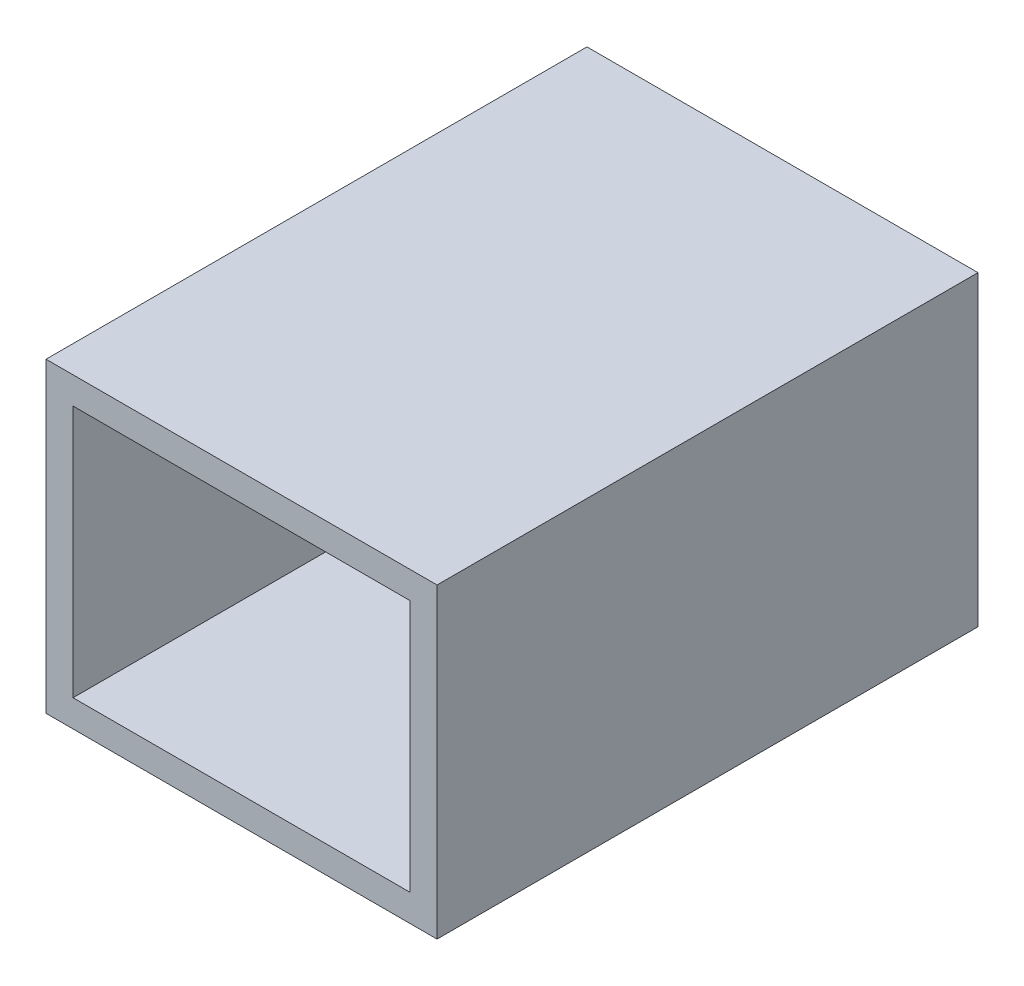
ISO-10303-21;
HEADER;
FILE_DESCRIPTION(('STEP AP214'),'2;1');
FILE_NAME('part.step','',(''),(''),'','','');
FILE_SCHEMA(('AUTOMOTIVE_DESIGN { 1 0 10303 214 1 1 1 1 }'));
ENDSEC;
DATA;
#1=APPLICATION_CONTEXT('core data for automotive mechanical design processes');
#2=APPLICATION_PROTOCOL_DEFINITION('international standard','automotive_design',2000,#1);
#3=PRODUCT_CONTEXT('',#1,'mechanical');
#4=PRODUCT('Part','Part','',(#3));
#5=PRODUCT_RELATED_PRODUCT_CATEGORY('part','',(#4));
#6=PRODUCT_DEFINITION_FORMATION('','',#4);
#7=PRODUCT_DEFINITION_CONTEXT('part definition',#1,'design');
#8=PRODUCT_DEFINITION('design','',#6,#7);
#9=PRODUCT_DEFINITION_SHAPE('','',#8);
#10=(LENGTH_UNIT() NAMED_UNIT(*) SI_UNIT(.MILLI.,.METRE.));
#11=(NAMED_UNIT(*) PLANE_ANGLE_UNIT() SI_UNIT($,.RADIAN.));
#12=(NAMED_UNIT(*) SI_UNIT($,.STERADIAN.) SOLID_ANGLE_UNIT());
#13=UNCERTAINTY_MEASURE_WITH_UNIT(LENGTH_MEASURE(1.E-05),#10,'distance_accuracy_value','');
#14=(GEOMETRIC_REPRESENTATION_CONTEXT(3) GLOBAL_UNCERTAINTY_ASSIGNED_CONTEXT((#13)) GLOBAL_UNIT_ASSIGNED_CONTEXT((#10,
#11,#12)) REPRESENTATION_CONTEXT('',''));
#15=CARTESIAN_POINT('',(0.,0.,0.));
#16=DIRECTION('',(0.,0.,1.));
#17=DIRECTION('',(1.,0.,0.));
#18=AXIS2_PLACEMENT_3D('',#15,#16,#17);
#19=CARTESIAN_POINT('',(0.,0.,200.));
#20=DIRECTION('',(0.,0.,-1.));
#21=DIRECTION('',(-1.,0.,0.));
#22=AXIS2_PLACEMENT_3D('',#19,#20,#21);
#23=PLANE('',#22);
#24=DIRECTION('',(0.,1.,0.));
#25=VECTOR('',#24,1.);
#26=CARTESIAN_POINT('',(72.2835547727534,-56.6956910569106,200.));
#27=LINE('',#26,#25);
#28=CARTESIAN_POINT('',(72.2835547727534,-56.6956910569106,200.));
#29=VERTEX_POINT('',#28);
#30=CARTESIAN_POINT('',(72.2835547727534,56.6956910569106,200.));
#31=VERTEX_POINT('',#30);
#32=EDGE_CURVE('E141',#29,#31,#27,.T.);
#33=ORIENTED_EDGE('',*,*,#32,.T.);
#34=DIRECTION('',(-1.,0.,0.));
#35=VECTOR('',#34,1.);
#36=CARTESIAN_POINT('',(-72.2835547727534,56.6956910569106,200.));
#37=LINE('',#36,#35);
#38=CARTESIAN_POINT('',(-72.2835547727534,56.6956910569106,200.));
#39=VERTEX_POINT('',#38);
#40=EDGE_CURVE('E85',#31,#39,#37,.T.);
#41=ORIENTED_EDGE('',*,*,#40,.T.);
#42=DIRECTION('',(0.,-1.,0.));
#43=VECTOR('',#42,1.);
#44=CARTESIAN_POINT('',(-72.2835547727534,-56.6956910569106,200.));
#45=LINE('',#44,#43);
#46=CARTESIAN_POINT('',(-72.2835547727534,-56.6956910569106,200.));
#47=VERTEX_POINT('',#46);
#48=EDGE_CURVE('E144',#39,#47,#45,.T.);
#49=ORIENTED_EDGE('',*,*,#48,.T.);
#50=DIRECTION('',(1.,0.,0.));
#51=VECTOR('',#50,1.);
#52=CARTESIAN_POINT('',(-72.2835547727534,-56.6956910569106,200.));
#53=LINE('',#52,#51);
#54=EDGE_CURVE('E57',#47,#29,#53,.T.);
#55=ORIENTED_EDGE('',*,*,#54,.T.);
#56=EDGE_LOOP('',(#33,#41,#49,#55));
#57=FACE_BOUND('',#56,.T.);
#58=DIRECTION('',(0.,1.,0.));
#59=VECTOR('',#58,1.);
#60=CARTESIAN_POINT('',(62.2835547727534,0.,200.));
#61=LINE('',#60,#59);
#62=CARTESIAN_POINT('',(62.2835547727534,-46.6956910569106,200.));
#63=VERTEX_POINT('',#62);
#64=CARTESIAN_POINT('',(62.2835547727534,46.6956910569106,200.));
#65=VERTEX_POINT('',#64);
#66=EDGE_CURVE('E130',#63,#65,#61,.T.);
#67=ORIENTED_EDGE('',*,*,#66,.F.);
#68=DIRECTION('',(1.,0.,0.));
#69=VECTOR('',#68,1.);
#70=CARTESIAN_POINT('',(0.,-46.6956910569106,200.));
#71=LINE('',#70,#69);
#72=CARTESIAN_POINT('',(-62.2835547727534,-46.6956910569106,200.));
#73=VERTEX_POINT('',#72);
#74=EDGE_CURVE('E139',#73,#63,#71,.T.);
#75=ORIENTED_EDGE('',*,*,#74,.F.);
#76=DIRECTION('',(0.,-1.,0.));
#77=VECTOR('',#76,1.);
#78=CARTESIAN_POINT('',(-62.2835547727534,0.,200.));
#79=LINE('',#78,#77);
#80=CARTESIAN_POINT('',(-62.2835547727534,46.6956910569106,200.));
#81=VERTEX_POINT('',#80);
#82=EDGE_CURVE('E137',#81,#73,#79,.T.);
#83=ORIENTED_EDGE('',*,*,#82,.F.);
#84=DIRECTION('',(-1.,0.,0.));
#85=VECTOR('',#84,1.);
#86=CARTESIAN_POINT('',(0.,46.6956910569106,200.));
#87=LINE('',#86,#85);
#88=EDGE_CURVE('E122',#65,#81,#87,.T.);
#89=ORIENTED_EDGE('',*,*,#88,.F.);
#90=EDGE_LOOP('',(#67,#75,#83,#89));
#91=FACE_BOUND('',#90,.T.);
#92=ADVANCED_FACE('F33',(#57,#91),#23,.F.);
#93=CARTESIAN_POINT('',(72.2835547727534,-56.6956910569106,200.));
#94=DIRECTION('',(-1.,0.,0.));
#95=DIRECTION('',(0.,0.,1.));
#96=AXIS2_PLACEMENT_3D('',#93,#94,#95);
#97=PLANE('',#96);
#98=DIRECTION('',(0.,1.,0.));
#99=VECTOR('',#98,1.);
#100=CARTESIAN_POINT('',(72.2835547727534,-56.6956910569106,0.));
#101=LINE('',#100,#99);
#102=CARTESIAN_POINT('',(72.2835547727534,-56.6956910569106,0.));
#103=VERTEX_POINT('',#102);
#104=CARTESIAN_POINT('',(72.2835547727534,56.6956910569106,0.));
#105=VERTEX_POINT('',#104);
#106=EDGE_CURVE('E148',#103,#105,#101,.T.);
#107=ORIENTED_EDGE('',*,*,#106,.T.);
#108=DIRECTION('',(0.,0.,-1.));
#109=VECTOR('',#108,1.);
#110=CARTESIAN_POINT('',(72.2835547727534,56.6956910569106,200.));
#111=LINE('',#110,#109);
#112=EDGE_CURVE('E11',#31,#105,#111,.T.);
#113=ORIENTED_EDGE('',*,*,#112,.F.);
#114=ORIENTED_EDGE('',*,*,#32,.F.);
#115=DIRECTION('',(0.,0.,-1.));
#116=VECTOR('',#115,1.);
#117=CARTESIAN_POINT('',(72.2835547727534,-56.6956910569106,200.));
#118=LINE('',#117,#116);
#119=EDGE_CURVE('E147',#29,#103,#118,.T.);
#120=ORIENTED_EDGE('',*,*,#119,.T.);
#121=EDGE_LOOP('',(#107,#113,#114,#120));
#122=FACE_BOUND('',#121,.T.);
#123=ADVANCED_FACE('F35',(#122),#97,.F.);
#124=CARTESIAN_POINT('',(-72.2835547727534,56.6956910569106,200.));
#125=DIRECTION('',(0.,-1.,0.));
#126=DIRECTION('',(0.,0.,-1.));
#127=AXIS2_PLACEMENT_3D('',#124,#125,#126);
#128=PLANE('',#127);
#129=DIRECTION('',(-1.,0.,0.));
#130=VECTOR('',#129,1.);
#131=CARTESIAN_POINT('',(-72.2835547727534,56.6956910569106,0.));
#132=LINE('',#131,#130);
#133=CARTESIAN_POINT('',(-72.2835547727534,56.6956910569106,0.));
#134=VERTEX_POINT('',#133);
#135=EDGE_CURVE('E151',#105,#134,#132,.T.);
#136=ORIENTED_EDGE('',*,*,#135,.T.);
#137=DIRECTION('',(0.,0.,-1.));
#138=VECTOR('',#137,1.);
#139=CARTESIAN_POINT('',(-72.2835547727534,56.6956910569106,200.));
#140=LINE('',#139,#138);
#141=EDGE_CURVE('E41',#39,#134,#140,.T.);
#142=ORIENTED_EDGE('',*,*,#141,.F.);
#143=ORIENTED_EDGE('',*,*,#40,.F.);
#144=ORIENTED_EDGE('',*,*,#112,.T.);
#145=EDGE_LOOP('',(#136,#142,#143,#144));
#146=FACE_BOUND('',#145,.T.);
#147=ADVANCED_FACE('F179',(#146),#128,.F.);
#148=CARTESIAN_POINT('',(-72.2835547727534,-56.6956910569106,200.));
#149=DIRECTION('',(1.,0.,0.));
#150=DIRECTION('',(0.,0.,-1.));
#151=AXIS2_PLACEMENT_3D('',#148,#149,#150);
#152=PLANE('',#151);
#153=DIRECTION('',(0.,-1.,0.));
#154=VECTOR('',#153,1.);
#155=CARTESIAN_POINT('',(-72.2835547727534,-56.6956910569106,0.));
#156=LINE('',#155,#154);
#157=CARTESIAN_POINT('',(-72.2835547727534,-56.6956910569106,0.));
#158=VERTEX_POINT('',#157);
#159=EDGE_CURVE('E153',#134,#158,#156,.T.);
#160=ORIENTED_EDGE('',*,*,#159,.T.);
#161=DIRECTION('',(0.,0.,-1.));
#162=VECTOR('',#161,1.);
#163=CARTESIAN_POINT('',(-72.2835547727534,-56.6956910569106,200.));
#164=LINE('',#163,#162);
#165=EDGE_CURVE('E157',#47,#158,#164,.T.);
#166=ORIENTED_EDGE('',*,*,#165,.F.);
#167=ORIENTED_EDGE('',*,*,#48,.F.);
#168=ORIENTED_EDGE('',*,*,#141,.T.);
#169=EDGE_LOOP('',(#160,#166,#167,#168));
#170=FACE_BOUND('',#169,.T.);
#171=ADVANCED_FACE('F162',(#170),#152,.F.);
#172=CARTESIAN_POINT('',(-72.2835547727534,-56.6956910569106,200.));
#173=DIRECTION('',(0.,1.,0.));
#174=DIRECTION('',(0.,0.,1.));
#175=AXIS2_PLACEMENT_3D('',#172,#173,#174);
#176=PLANE('',#175);
#177=DIRECTION('',(1.,0.,0.));
#178=VECTOR('',#177,1.);
#179=CARTESIAN_POINT('',(-72.2835547727534,-56.6956910569106,0.));
#180=LINE('',#179,#178);
#181=EDGE_CURVE('E78',#158,#103,#180,.T.);
#182=ORIENTED_EDGE('',*,*,#181,.T.);
#183=ORIENTED_EDGE('',*,*,#119,.F.);
#184=ORIENTED_EDGE('',*,*,#54,.F.);
#185=ORIENTED_EDGE('',*,*,#165,.T.);
#186=EDGE_LOOP('',(#182,#183,#184,#185));
#187=FACE_BOUND('',#186,.T.);
#188=ADVANCED_FACE('F170',(#187),#176,.F.);
#189=CARTESIAN_POINT('',(0.,0.,0.));
#190=DIRECTION('',(0.,0.,-1.));
#191=DIRECTION('',(-1.,0.,0.));
#192=AXIS2_PLACEMENT_3D('',#189,#190,#191);
#193=PLANE('',#192);
#194=ORIENTED_EDGE('',*,*,#106,.F.);
#195=ORIENTED_EDGE('',*,*,#181,.F.);
#196=ORIENTED_EDGE('',*,*,#159,.F.);
#197=ORIENTED_EDGE('',*,*,#135,.F.);
#198=EDGE_LOOP('',(#194,#195,#196,#197));
#199=FACE_BOUND('',#198,.T.);
#200=ADVANCED_FACE('F166',(#199),#193,.T.);
#201=CARTESIAN_POINT('',(62.2835547727534,-56.6956910569106,200.));
#202=DIRECTION('',(-1.,0.,0.));
#203=DIRECTION('',(0.,0.,1.));
#204=AXIS2_PLACEMENT_3D('',#201,#202,#203);
#205=PLANE('',#204);
#206=DIRECTION('',(0.,1.,0.));
#207=VECTOR('',#206,1.);
#208=CARTESIAN_POINT('',(62.2835547727534,0.,10.));
#209=LINE('',#208,#207);
#210=CARTESIAN_POINT('',(62.2835547727534,-46.6956910569106,10.));
#211=VERTEX_POINT('',#210);
#212=CARTESIAN_POINT('',(62.2835547727534,46.6956910569106,10.));
#213=VERTEX_POINT('',#212);
#214=EDGE_CURVE('E113',#211,#213,#209,.T.);
#215=ORIENTED_EDGE('',*,*,#214,.F.);
#216=DIRECTION('',(0.,0.,-1.));
#217=VECTOR('',#216,1.);
#218=CARTESIAN_POINT('',(62.2835547727534,-46.6956910569106,200.));
#219=LINE('',#218,#217);
#220=EDGE_CURVE('E133',#63,#211,#219,.T.);
#221=ORIENTED_EDGE('',*,*,#220,.F.);
#222=ORIENTED_EDGE('',*,*,#66,.T.);
#223=DIRECTION('',(0.,0.,-1.));
#224=VECTOR('',#223,1.);
#225=CARTESIAN_POINT('',(62.2835547727534,46.6956910569106,200.));
#226=LINE('',#225,#224);
#227=EDGE_CURVE('E125',#65,#213,#226,.T.);
#228=ORIENTED_EDGE('',*,*,#227,.T.);
#229=EDGE_LOOP('',(#215,#221,#222,#228));
#230=FACE_BOUND('',#229,.T.);
#231=ADVANCED_FACE('F177',(#230),#205,.T.);
#232=CARTESIAN_POINT('',(-72.2835547727534,46.6956910569106,200.));
#233=DIRECTION('',(0.,-1.,0.));
#234=DIRECTION('',(0.,0.,-1.));
#235=AXIS2_PLACEMENT_3D('',#232,#233,#234);
#236=PLANE('',#235);
#237=DIRECTION('',(-1.,0.,0.));
#238=VECTOR('',#237,1.);
#239=CARTESIAN_POINT('',(0.,46.6956910569106,10.));
#240=LINE('',#239,#238);
#241=CARTESIAN_POINT('',(-62.2835547727534,46.6956910569106,10.));
#242=VERTEX_POINT('',#241);
#243=EDGE_CURVE('E107',#213,#242,#240,.T.);
#244=ORIENTED_EDGE('',*,*,#243,.F.);
#245=ORIENTED_EDGE('',*,*,#227,.F.);
#246=ORIENTED_EDGE('',*,*,#88,.T.);
#247=DIRECTION('',(0.,0.,-1.));
#248=VECTOR('',#247,1.);
#249=CARTESIAN_POINT('',(-62.2835547727534,46.6956910569106,200.));
#250=LINE('',#249,#248);
#251=EDGE_CURVE('E119',#81,#242,#250,.T.);
#252=ORIENTED_EDGE('',*,*,#251,.T.);
#253=EDGE_LOOP('',(#244,#245,#246,#252));
#254=FACE_BOUND('',#253,.T.);
#255=ADVANCED_FACE('F120',(#254),#236,.T.);
#256=CARTESIAN_POINT('',(-62.2835547727534,-56.6956910569106,200.));
#257=DIRECTION('',(1.,0.,0.));
#258=DIRECTION('',(0.,0.,-1.));
#259=AXIS2_PLACEMENT_3D('',#256,#257,#258);
#260=PLANE('',#259);
#261=DIRECTION('',(0.,-1.,0.));
#262=VECTOR('',#261,1.);
#263=CARTESIAN_POINT('',(-62.2835547727534,0.,10.));
#264=LINE('',#263,#262);
#265=CARTESIAN_POINT('',(-62.2835547727534,-46.6956910569106,10.));
#266=VERTEX_POINT('',#265);
#267=EDGE_CURVE('E111',#242,#266,#264,.T.);
#268=ORIENTED_EDGE('',*,*,#267,.F.);
#269=ORIENTED_EDGE('',*,*,#251,.F.);
#270=ORIENTED_EDGE('',*,*,#82,.T.);
#271=DIRECTION('',(0.,0.,-1.));
#272=VECTOR('',#271,1.);
#273=CARTESIAN_POINT('',(-62.2835547727534,-46.6956910569106,200.));
#274=LINE('',#273,#272);
#275=EDGE_CURVE('E48',#73,#266,#274,.T.);
#276=ORIENTED_EDGE('',*,*,#275,.T.);
#277=EDGE_LOOP('',(#268,#269,#270,#276));
#278=FACE_BOUND('',#277,.T.);
#279=ADVANCED_FACE('F127',(#278),#260,.T.);
#280=CARTESIAN_POINT('',(-72.2835547727534,-46.6956910569106,200.));
#281=DIRECTION('',(0.,1.,0.));
#282=DIRECTION('',(0.,0.,1.));
#283=AXIS2_PLACEMENT_3D('',#280,#281,#282);
#284=PLANE('',#283);
#285=DIRECTION('',(1.,0.,0.));
#286=VECTOR('',#285,1.);
#287=CARTESIAN_POINT('',(0.,-46.6956910569106,10.));
#288=LINE('',#287,#286);
#289=EDGE_CURVE('E128',#266,#211,#288,.T.);
#290=ORIENTED_EDGE('',*,*,#289,.F.);
#291=ORIENTED_EDGE('',*,*,#275,.F.);
#292=ORIENTED_EDGE('',*,*,#74,.T.);
#293=ORIENTED_EDGE('',*,*,#220,.T.);
#294=EDGE_LOOP('',(#290,#291,#292,#293));
#295=FACE_BOUND('',#294,.T.);
#296=ADVANCED_FACE('F190',(#295),#284,.T.);
#297=CARTESIAN_POINT('',(0.,0.,10.));
#298=DIRECTION('',(0.,0.,-1.));
#299=DIRECTION('',(-1.,0.,0.));
#300=AXIS2_PLACEMENT_3D('',#297,#298,#299);
#301=PLANE('',#300);
#302=ORIENTED_EDGE('',*,*,#214,.T.);
#303=ORIENTED_EDGE('',*,*,#243,.T.);
#304=ORIENTED_EDGE('',*,*,#267,.T.);
#305=ORIENTED_EDGE('',*,*,#289,.T.);
#306=EDGE_LOOP('',(#302,#303,#304,#305));
#307=FACE_BOUND('',#306,.T.);
#308=ADVANCED_FACE('F109',(#307),#301,.F.);
#309=CLOSED_SHELL('',(#92,#123,#147,#171,#188,#200,#231,#255,#279,#296,#308));
#310=MANIFOLD_SOLID_BREP('B2',#309);
#311=ADVANCED_BREP_SHAPE_REPRESENTATION('',(#18,#310),#14);
#312=SHAPE_DEFINITION_REPRESENTATION(#9,#311);
ENDSEC;
END-ISO-10303-21;
